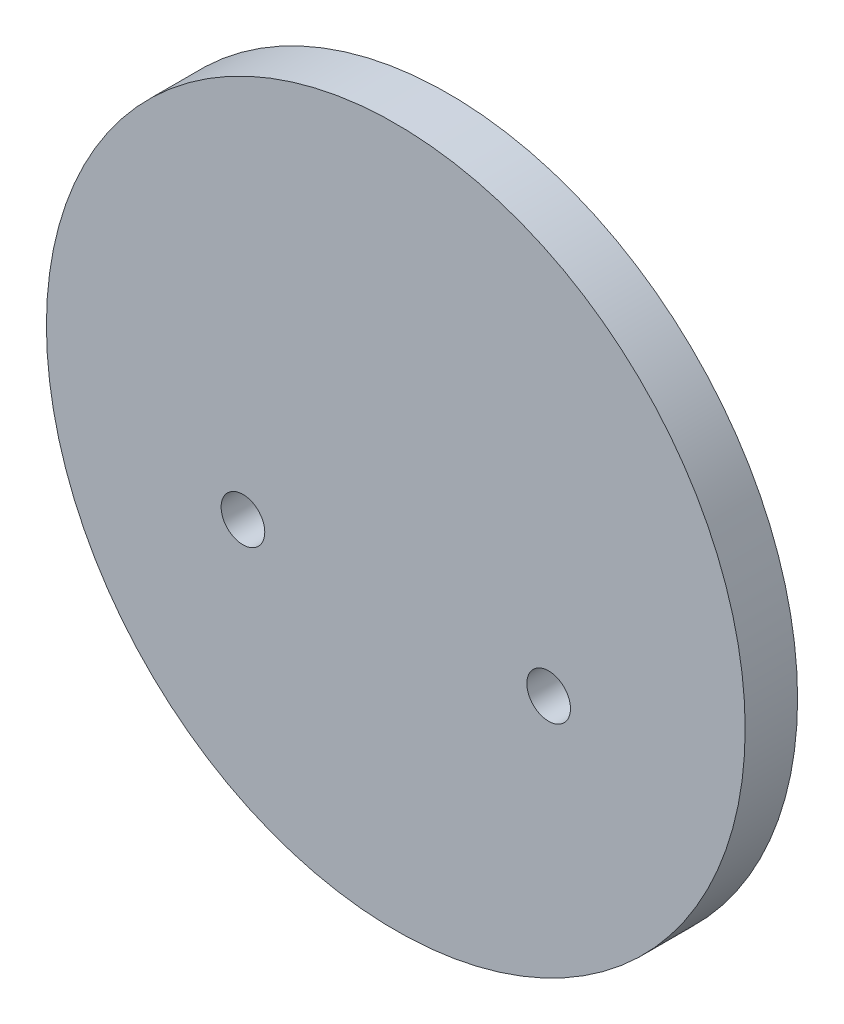
ISO-10303-21;
HEADER;
FILE_DESCRIPTION(('STEP AP214'),'2;1');
FILE_NAME('part.step','',(''),(''),'','','');
FILE_SCHEMA(('AUTOMOTIVE_DESIGN { 1 0 10303 214 1 1 1 1 }'));
ENDSEC;
DATA;
#1=APPLICATION_CONTEXT('core data for automotive mechanical design processes');
#2=APPLICATION_PROTOCOL_DEFINITION('international standard','automotive_design',2000,#1);
#3=PRODUCT_CONTEXT('',#1,'mechanical');
#4=PRODUCT('Part','Part','',(#3));
#5=PRODUCT_RELATED_PRODUCT_CATEGORY('part','',(#4));
#6=PRODUCT_DEFINITION_FORMATION('','',#4);
#7=PRODUCT_DEFINITION_CONTEXT('part definition',#1,'design');
#8=PRODUCT_DEFINITION('design','',#6,#7);
#9=PRODUCT_DEFINITION_SHAPE('','',#8);
#10=(LENGTH_UNIT() NAMED_UNIT(*) SI_UNIT(.MILLI.,.METRE.));
#11=(NAMED_UNIT(*) PLANE_ANGLE_UNIT() SI_UNIT($,.RADIAN.));
#12=(NAMED_UNIT(*) SI_UNIT($,.STERADIAN.) SOLID_ANGLE_UNIT());
#13=UNCERTAINTY_MEASURE_WITH_UNIT(LENGTH_MEASURE(1.E-05),#10,'distance_accuracy_value','');
#14=(GEOMETRIC_REPRESENTATION_CONTEXT(3) GLOBAL_UNCERTAINTY_ASSIGNED_CONTEXT((#13)) GLOBAL_UNIT_ASSIGNED_CONTEXT((#10,
#11,#12)) REPRESENTATION_CONTEXT('',''));
#15=CARTESIAN_POINT('',(0.,0.,0.));
#16=DIRECTION('',(0.,0.,1.));
#17=DIRECTION('',(1.,0.,0.));
#18=AXIS2_PLACEMENT_3D('',#15,#16,#17);
#19=CARTESIAN_POINT('',(17.5,-8.,0.));
#20=DIRECTION('',(0.,0.,1.));
#21=DIRECTION('',(1.,0.,0.));
#22=AXIS2_PLACEMENT_3D('',#19,#20,#21);
#23=CYLINDRICAL_SURFACE('',#22,2.5);
#24=CARTESIAN_POINT('',(17.5,-8.,6.));
#25=DIRECTION('',(0.,0.,1.));
#26=DIRECTION('',(1.,0.,0.));
#27=AXIS2_PLACEMENT_3D('',#24,#25,#26);
#28=CIRCLE('',#27,2.5);
#29=CARTESIAN_POINT('',(20.,-8.,6.));
#30=VERTEX_POINT('',#29);
#31=EDGE_CURVE('E67',#30,#30,#28,.T.);
#32=ORIENTED_EDGE('',*,*,#31,.T.);
#33=EDGE_LOOP('',(#32));
#34=FACE_BOUND('',#33,.T.);
#35=CARTESIAN_POINT('',(17.5,-8.,1.5));
#36=DIRECTION('',(0.,0.,-1.));
#37=DIRECTION('',(-1.,0.,0.));
#38=AXIS2_PLACEMENT_3D('',#35,#36,#37);
#39=CIRCLE('',#38,2.5);
#40=CARTESIAN_POINT('',(15.,-8.,1.5));
#41=VERTEX_POINT('',#40);
#42=EDGE_CURVE('E47',#41,#41,#39,.F.);
#43=ORIENTED_EDGE('',*,*,#42,.F.);
#44=EDGE_LOOP('',(#43));
#45=FACE_BOUND('',#44,.T.);
#46=ADVANCED_FACE('F44',(#34,#45),#23,.F.);
#47=CARTESIAN_POINT('',(-17.5,-8.,0.));
#48=DIRECTION('',(0.,0.,1.));
#49=DIRECTION('',(1.,0.,0.));
#50=AXIS2_PLACEMENT_3D('',#47,#48,#49);
#51=CYLINDRICAL_SURFACE('',#50,2.5);
#52=CARTESIAN_POINT('',(-17.5,-8.,6.));
#53=DIRECTION('',(0.,0.,1.));
#54=DIRECTION('',(1.,0.,0.));
#55=AXIS2_PLACEMENT_3D('',#52,#53,#54);
#56=CIRCLE('',#55,2.5);
#57=CARTESIAN_POINT('',(-15.,-8.,6.));
#58=VERTEX_POINT('',#57);
#59=EDGE_CURVE('E58',#58,#58,#56,.T.);
#60=ORIENTED_EDGE('',*,*,#59,.T.);
#61=EDGE_LOOP('',(#60));
#62=FACE_BOUND('',#61,.T.);
#63=CARTESIAN_POINT('',(-17.5,-8.,1.5));
#64=DIRECTION('',(0.,0.,-1.));
#65=DIRECTION('',(-1.,0.,0.));
#66=AXIS2_PLACEMENT_3D('',#63,#64,#65);
#67=CIRCLE('',#66,2.5);
#68=CARTESIAN_POINT('',(-20.,-8.,1.5));
#69=VERTEX_POINT('',#68);
#70=EDGE_CURVE('E68',#69,#69,#67,.F.);
#71=ORIENTED_EDGE('',*,*,#70,.F.);
#72=EDGE_LOOP('',(#71));
#73=FACE_BOUND('',#72,.T.);
#74=ADVANCED_FACE('F83',(#62,#73),#51,.F.);
#75=CARTESIAN_POINT('',(0.,0.,6.));
#76=DIRECTION('',(0.,0.,-1.));
#77=DIRECTION('',(-1.,0.,0.));
#78=AXIS2_PLACEMENT_3D('',#75,#76,#77);
#79=CYLINDRICAL_SURFACE('',#78,40.);
#80=CARTESIAN_POINT('',(0.,0.,6.));
#81=DIRECTION('',(0.,0.,1.));
#82=DIRECTION('',(1.,0.,0.));
#83=AXIS2_PLACEMENT_3D('',#80,#81,#82);
#84=CIRCLE('',#83,40.);
#85=CARTESIAN_POINT('',(40.,0.,6.));
#86=VERTEX_POINT('',#85);
#87=EDGE_CURVE('E11',#86,#86,#84,.T.);
#88=ORIENTED_EDGE('',*,*,#87,.F.);
#89=EDGE_LOOP('',(#88));
#90=FACE_BOUND('',#89,.T.);
#91=CARTESIAN_POINT('',(0.,0.,0.));
#92=DIRECTION('',(0.,0.,1.));
#93=DIRECTION('',(1.,0.,0.));
#94=AXIS2_PLACEMENT_3D('',#91,#92,#93);
#95=CIRCLE('',#94,40.);
#96=CARTESIAN_POINT('',(40.,0.,0.));
#97=VERTEX_POINT('',#96);
#98=EDGE_CURVE('E52',#97,#97,#95,.T.);
#99=ORIENTED_EDGE('',*,*,#98,.T.);
#100=EDGE_LOOP('',(#99));
#101=FACE_BOUND('',#100,.T.);
#102=ADVANCED_FACE('F88',(#90,#101),#79,.T.);
#103=CARTESIAN_POINT('',(0.,0.,6.));
#104=DIRECTION('',(0.,0.,1.));
#105=DIRECTION('',(1.,0.,0.));
#106=AXIS2_PLACEMENT_3D('',#103,#104,#105);
#107=PLANE('',#106);
#108=ORIENTED_EDGE('',*,*,#59,.F.);
#109=EDGE_LOOP('',(#108));
#110=FACE_BOUND('',#109,.T.);
#111=ORIENTED_EDGE('',*,*,#31,.F.);
#112=EDGE_LOOP('',(#111));
#113=FACE_BOUND('',#112,.T.);
#114=ORIENTED_EDGE('',*,*,#87,.T.);
#115=EDGE_LOOP('',(#114));
#116=FACE_BOUND('',#115,.T.);
#117=ADVANCED_FACE('F94',(#110,#113,#116),#107,.T.);
#118=CARTESIAN_POINT('',(0.,0.,0.));
#119=DIRECTION('',(0.,0.,1.));
#120=DIRECTION('',(1.,0.,0.));
#121=AXIS2_PLACEMENT_3D('',#118,#119,#120);
#122=PLANE('',#121);
#123=CARTESIAN_POINT('',(17.5,-8.,0.));
#124=DIRECTION('',(0.,0.,-1.));
#125=DIRECTION('',(-1.,0.,0.));
#126=AXIS2_PLACEMENT_3D('',#123,#124,#125);
#127=CIRCLE('',#126,5.);
#128=CARTESIAN_POINT('',(12.5,-8.,0.));
#129=VERTEX_POINT('',#128);
#130=EDGE_CURVE('E123',#129,#129,#127,.T.);
#131=ORIENTED_EDGE('',*,*,#130,.F.);
#132=EDGE_LOOP('',(#131));
#133=FACE_BOUND('',#132,.T.);
#134=CARTESIAN_POINT('',(-17.5,-8.,0.));
#135=DIRECTION('',(0.,0.,-1.));
#136=DIRECTION('',(-1.,0.,0.));
#137=AXIS2_PLACEMENT_3D('',#134,#135,#136);
#138=CIRCLE('',#137,5.);
#139=CARTESIAN_POINT('',(-22.5,-8.,0.));
#140=VERTEX_POINT('',#139);
#141=EDGE_CURVE('E127',#140,#140,#138,.T.);
#142=ORIENTED_EDGE('',*,*,#141,.F.);
#143=EDGE_LOOP('',(#142));
#144=FACE_BOUND('',#143,.T.);
#145=ORIENTED_EDGE('',*,*,#98,.F.);
#146=EDGE_LOOP('',(#145));
#147=FACE_BOUND('',#146,.T.);
#148=ADVANCED_FACE('F99',(#133,#144,#147),#122,.F.);
#149=CARTESIAN_POINT('',(-17.5,-8.,1.5));
#150=DIRECTION('',(0.,0.,-1.));
#151=DIRECTION('',(-1.,0.,0.));
#152=AXIS2_PLACEMENT_3D('',#149,#150,#151);
#153=PLANE('',#152);
#154=CARTESIAN_POINT('',(-17.5,-8.,1.5));
#155=DIRECTION('',(0.,0.,-1.));
#156=DIRECTION('',(-1.,0.,0.));
#157=AXIS2_PLACEMENT_3D('',#154,#155,#156);
#158=CIRCLE('',#157,5.);
#159=CARTESIAN_POINT('',(-22.5,-8.,1.5));
#160=VERTEX_POINT('',#159);
#161=EDGE_CURVE('E61',#160,#160,#158,.T.);
#162=ORIENTED_EDGE('',*,*,#161,.T.);
#163=EDGE_LOOP('',(#162));
#164=FACE_BOUND('',#163,.T.);
#165=ORIENTED_EDGE('',*,*,#70,.T.);
#166=EDGE_LOOP('',(#165));
#167=FACE_BOUND('',#166,.T.);
#168=ADVANCED_FACE('F102',(#164,#167),#153,.T.);
#169=CARTESIAN_POINT('',(-17.5,-8.,1.5));
#170=DIRECTION('',(0.,0.,-1.));
#171=DIRECTION('',(-1.,0.,0.));
#172=AXIS2_PLACEMENT_3D('',#169,#170,#171);
#173=CYLINDRICAL_SURFACE('',#172,5.);
#174=ORIENTED_EDGE('',*,*,#161,.F.);
#175=EDGE_LOOP('',(#174));
#176=FACE_BOUND('',#175,.T.);
#177=ORIENTED_EDGE('',*,*,#141,.T.);
#178=EDGE_LOOP('',(#177));
#179=FACE_BOUND('',#178,.T.);
#180=ADVANCED_FACE('F108',(#176,#179),#173,.F.);
#181=CARTESIAN_POINT('',(17.5,-8.,1.5));
#182=DIRECTION('',(0.,0.,-1.));
#183=DIRECTION('',(-1.,0.,0.));
#184=AXIS2_PLACEMENT_3D('',#181,#182,#183);
#185=PLANE('',#184);
#186=CARTESIAN_POINT('',(17.5,-8.,1.5));
#187=DIRECTION('',(0.,0.,-1.));
#188=DIRECTION('',(-1.,0.,0.));
#189=AXIS2_PLACEMENT_3D('',#186,#187,#188);
#190=CIRCLE('',#189,5.);
#191=CARTESIAN_POINT('',(12.5,-8.,1.5));
#192=VERTEX_POINT('',#191);
#193=EDGE_CURVE('E71',#192,#192,#190,.T.);
#194=ORIENTED_EDGE('',*,*,#193,.T.);
#195=EDGE_LOOP('',(#194));
#196=FACE_BOUND('',#195,.T.);
#197=ORIENTED_EDGE('',*,*,#42,.T.);
#198=EDGE_LOOP('',(#197));
#199=FACE_BOUND('',#198,.T.);
#200=ADVANCED_FACE('F80',(#196,#199),#185,.T.);
#201=CARTESIAN_POINT('',(17.5,-8.,1.5));
#202=DIRECTION('',(0.,0.,-1.));
#203=DIRECTION('',(-1.,0.,0.));
#204=AXIS2_PLACEMENT_3D('',#201,#202,#203);
#205=CYLINDRICAL_SURFACE('',#204,5.);
#206=ORIENTED_EDGE('',*,*,#193,.F.);
#207=EDGE_LOOP('',(#206));
#208=FACE_BOUND('',#207,.T.);
#209=ORIENTED_EDGE('',*,*,#130,.T.);
#210=EDGE_LOOP('',(#209));
#211=FACE_BOUND('',#210,.T.);
#212=ADVANCED_FACE('F113',(#208,#211),#205,.F.);
#213=CLOSED_SHELL('',(#46,#74,#102,#117,#148,#168,#180,#200,#212));
#214=MANIFOLD_SOLID_BREP('B2',#213);
#215=ADVANCED_BREP_SHAPE_REPRESENTATION('',(#18,#214),#14);
#216=SHAPE_DEFINITION_REPRESENTATION(#9,#215);
ENDSEC;
END-ISO-10303-21;
